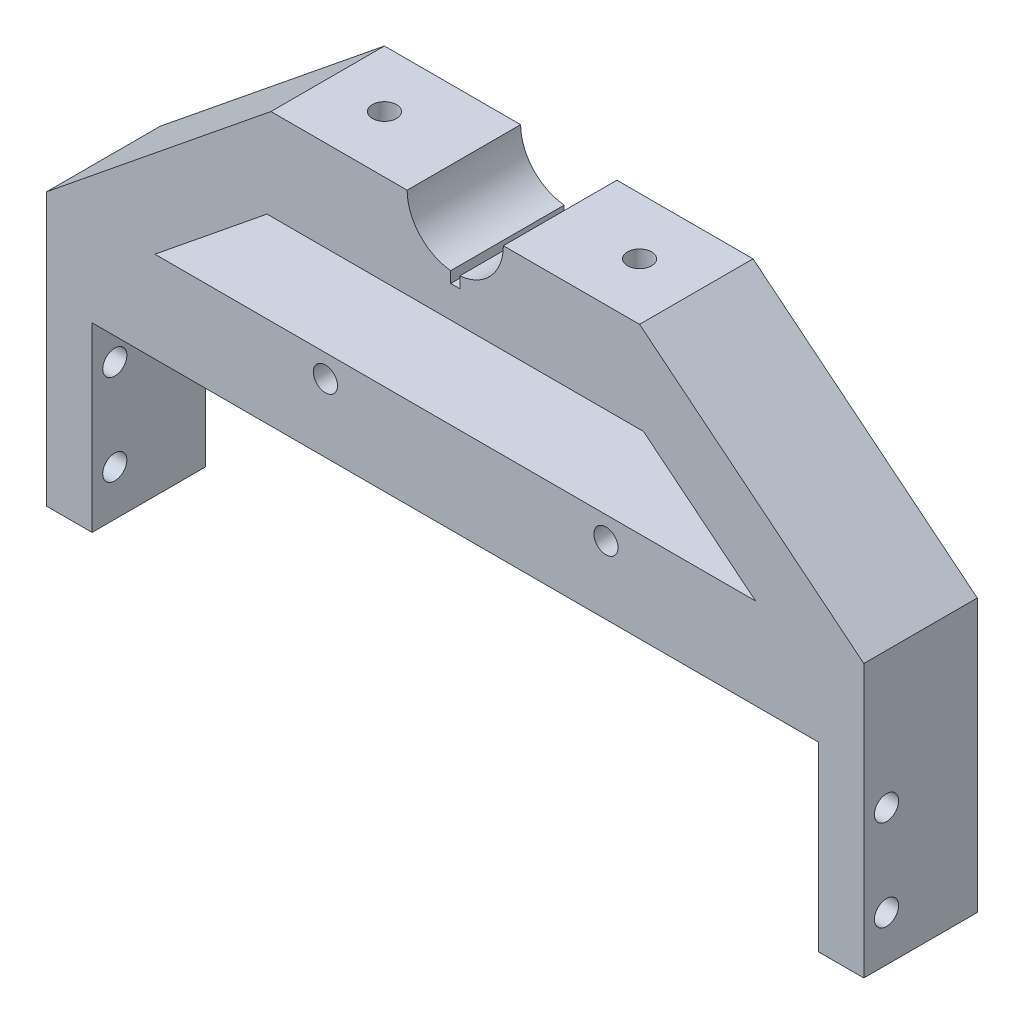
ISO-10303-21;
HEADER;
FILE_DESCRIPTION(('STEP AP214'),'2;1');
FILE_NAME('part.step','',(''),(''),'','','');
FILE_SCHEMA(('AUTOMOTIVE_DESIGN { 1 0 10303 214 1 1 1 1 }'));
ENDSEC;
DATA;
#1=APPLICATION_CONTEXT('core data for automotive mechanical design processes');
#2=APPLICATION_PROTOCOL_DEFINITION('international standard','automotive_design',2000,#1);
#3=PRODUCT_CONTEXT('',#1,'mechanical');
#4=PRODUCT('Part','Part','',(#3));
#5=PRODUCT_RELATED_PRODUCT_CATEGORY('part','',(#4));
#6=PRODUCT_DEFINITION_FORMATION('','',#4);
#7=PRODUCT_DEFINITION_CONTEXT('part definition',#1,'design');
#8=PRODUCT_DEFINITION('design','',#6,#7);
#9=PRODUCT_DEFINITION_SHAPE('','',#8);
#10=(LENGTH_UNIT() NAMED_UNIT(*) SI_UNIT(.MILLI.,.METRE.));
#11=(NAMED_UNIT(*) PLANE_ANGLE_UNIT() SI_UNIT($,.RADIAN.));
#12=(NAMED_UNIT(*) SI_UNIT($,.STERADIAN.) SOLID_ANGLE_UNIT());
#13=UNCERTAINTY_MEASURE_WITH_UNIT(LENGTH_MEASURE(1.E-05),#10,'distance_accuracy_value','');
#14=(GEOMETRIC_REPRESENTATION_CONTEXT(3) GLOBAL_UNCERTAINTY_ASSIGNED_CONTEXT((#13)) GLOBAL_UNIT_ASSIGNED_CONTEXT((#10,
#11,#12)) REPRESENTATION_CONTEXT('',''));
#15=CARTESIAN_POINT('',(0.,0.,0.));
#16=DIRECTION('',(0.,0.,1.));
#17=DIRECTION('',(1.,0.,0.));
#18=AXIS2_PLACEMENT_3D('',#15,#16,#17);
#19=CARTESIAN_POINT('',(152.4,152.4,50.8));
#20=DIRECTION('',(0.,0.,-1.));
#21=DIRECTION('',(-1.,0.,0.));
#22=AXIS2_PLACEMENT_3D('',#19,#20,#21);
#23=CYLINDRICAL_SURFACE('',#22,13.462);
#24=DIRECTION('',(0.,0.,-1.));
#25=VECTOR('',#24,1.);
#26=CARTESIAN_POINT('',(151.13,138.998039546395,50.8));
#27=LINE('',#26,#25);
#28=CARTESIAN_POINT('',(151.13,138.998039546395,0.));
#29=VERTEX_POINT('',#28);
#30=CARTESIAN_POINT('',(151.13,138.998039546395,31.75));
#31=VERTEX_POINT('',#30);
#32=EDGE_CURVE('E215',#29,#31,#27,.F.);
#33=ORIENTED_EDGE('',*,*,#32,.F.);
#34=CARTESIAN_POINT('',(152.4,152.4,0.));
#35=DIRECTION('',(0.,0.,-1.));
#36=DIRECTION('',(1.,0.,0.));
#37=AXIS2_PLACEMENT_3D('',#34,#35,#36);
#38=CIRCLE('',#37,13.462);
#39=CARTESIAN_POINT('',(138.938,152.4,0.));
#40=VERTEX_POINT('',#39);
#41=EDGE_CURVE('E381',#29,#40,#38,.T.);
#42=ORIENTED_EDGE('',*,*,#41,.T.);
#43=DIRECTION('',(0.,0.,-1.));
#44=VECTOR('',#43,1.);
#45=CARTESIAN_POINT('',(138.938,152.4,50.8));
#46=LINE('',#45,#44);
#47=CARTESIAN_POINT('',(138.938,152.4,31.75));
#48=VERTEX_POINT('',#47);
#49=EDGE_CURVE('E400',#48,#40,#46,.T.);
#50=ORIENTED_EDGE('',*,*,#49,.F.);
#51=CARTESIAN_POINT('',(152.4,152.4,31.75));
#52=DIRECTION('',(0.,0.,-1.));
#53=DIRECTION('',(-1.,0.,0.));
#54=AXIS2_PLACEMENT_3D('',#51,#52,#53);
#55=CIRCLE('',#54,13.462);
#56=EDGE_CURVE('E299',#48,#31,#55,.F.);
#57=ORIENTED_EDGE('',*,*,#56,.T.);
#58=EDGE_LOOP('',(#33,#42,#50,#57));
#59=FACE_BOUND('',#58,.T.);
#60=ADVANCED_FACE('F39',(#59),#23,.F.);
#61=DIRECTION('',(0.,0.,-1.));
#62=VECTOR('',#61,1.);
#63=CARTESIAN_POINT('',(153.67,138.998039546395,50.8));
#64=LINE('',#63,#62);
#65=CARTESIAN_POINT('',(153.67,138.998039546395,31.75));
#66=VERTEX_POINT('',#65);
#67=CARTESIAN_POINT('',(153.67,138.998039546395,2.52176574657466E-13));
#68=VERTEX_POINT('',#67);
#69=EDGE_CURVE('E212',#66,#68,#64,.T.);
#70=ORIENTED_EDGE('',*,*,#69,.F.);
#71=CARTESIAN_POINT('',(165.862,152.4,31.75));
#72=VERTEX_POINT('',#71);
#73=EDGE_CURVE('E202',#66,#72,#55,.F.);
#74=ORIENTED_EDGE('',*,*,#73,.T.);
#75=DIRECTION('',(0.,0.,-1.));
#76=VECTOR('',#75,1.);
#77=CARTESIAN_POINT('',(165.862,152.4,50.8));
#78=LINE('',#77,#76);
#79=CARTESIAN_POINT('',(165.862,152.4,0.));
#80=VERTEX_POINT('',#79);
#81=EDGE_CURVE('E404',#72,#80,#78,.T.);
#82=ORIENTED_EDGE('',*,*,#81,.T.);
#83=EDGE_CURVE('E382',#80,#68,#38,.T.);
#84=ORIENTED_EDGE('',*,*,#83,.T.);
#85=EDGE_LOOP('',(#70,#74,#82,#84));
#86=FACE_BOUND('',#85,.T.);
#87=ADVANCED_FACE('F478',(#86),#23,.F.);
#88=CARTESIAN_POINT('',(152.4,152.4,0.));
#89=DIRECTION('',(0.,0.,1.));
#90=DIRECTION('',(1.,0.,0.));
#91=AXIS2_PLACEMENT_3D('',#88,#89,#90);
#92=PLANE('',#91);
#93=CARTESIAN_POINT('',(116.078,95.25,0.));
#94=DIRECTION('',(0.,0.,1.));
#95=DIRECTION('',(1.,0.,0.));
#96=AXIS2_PLACEMENT_3D('',#93,#94,#95);
#97=CIRCLE('',#96,3.37819999999999);
#98=CARTESIAN_POINT('',(119.4562,95.25,0.));
#99=VERTEX_POINT('',#98);
#100=EDGE_CURVE('E197',#99,#99,#97,.F.);
#101=ORIENTED_EDGE('',*,*,#100,.F.);
#102=EDGE_LOOP('',(#101));
#103=FACE_BOUND('',#102,.T.);
#104=CARTESIAN_POINT('',(194.564,95.25,0.));
#105=DIRECTION('',(0.,0.,1.));
#106=DIRECTION('',(1.,0.,0.));
#107=AXIS2_PLACEMENT_3D('',#104,#105,#106);
#108=CIRCLE('',#107,3.37819999999999);
#109=CARTESIAN_POINT('',(197.9422,95.25,0.));
#110=VERTEX_POINT('',#109);
#111=EDGE_CURVE('E490',#110,#110,#108,.F.);
#112=ORIENTED_EDGE('',*,*,#111,.F.);
#113=EDGE_LOOP('',(#112));
#114=FACE_BOUND('',#113,.T.);
#115=DIRECTION('',(-0.777171592090802,0.629288738535061,0.));
#116=VECTOR('',#115,1.);
#117=CARTESIAN_POINT('',(160.83082409555,162.812067758004,0.));
#118=LINE('',#117,#116);
#119=CARTESIAN_POINT('',(236.427727776685,101.6,0.));
#120=VERTEX_POINT('',#119);
#121=CARTESIAN_POINT('',(205.058727776685,127.,0.));
#122=VERTEX_POINT('',#121);
#123=EDGE_CURVE('E260',#120,#122,#118,.T.);
#124=ORIENTED_EDGE('',*,*,#123,.T.);
#125=DIRECTION('',(-1.,0.,0.));
#126=VECTOR('',#125,1.);
#127=CARTESIAN_POINT('',(152.4,127.,0.));
#128=LINE('',#127,#126);
#129=CARTESIAN_POINT('',(99.7412722233152,127.,0.));
#130=VERTEX_POINT('',#129);
#131=EDGE_CURVE('E248',#122,#130,#128,.T.);
#132=ORIENTED_EDGE('',*,*,#131,.T.);
#133=DIRECTION('',(-0.777171592090801,-0.629288738535062,0.));
#134=VECTOR('',#133,1.);
#135=CARTESIAN_POINT('',(143.96917590445,162.812067758004,0.));
#136=LINE('',#135,#134);
#137=CARTESIAN_POINT('',(68.3722722233152,101.6,0.));
#138=VERTEX_POINT('',#137);
#139=EDGE_CURVE('E252',#130,#138,#136,.T.);
#140=ORIENTED_EDGE('',*,*,#139,.T.);
#141=DIRECTION('',(1.,0.,0.));
#142=VECTOR('',#141,1.);
#143=CARTESIAN_POINT('',(152.4,101.6,0.));
#144=LINE('',#143,#142);
#145=EDGE_CURVE('E256',#138,#120,#144,.T.);
#146=ORIENTED_EDGE('',*,*,#145,.T.);
#147=EDGE_LOOP('',(#124,#132,#140,#146));
#148=FACE_BOUND('',#147,.T.);
#149=DIRECTION('',(0.,1.,0.));
#150=VECTOR('',#149,1.);
#151=CARTESIAN_POINT('',(151.13,135.89,0.));
#152=LINE('',#151,#150);
#153=CARTESIAN_POINT('',(151.13,135.89,0.));
#154=VERTEX_POINT('',#153);
#155=EDGE_CURVE('E207',#154,#29,#152,.T.);
#156=ORIENTED_EDGE('',*,*,#155,.F.);
#157=DIRECTION('',(1.,0.,0.));
#158=VECTOR('',#157,1.);
#159=CARTESIAN_POINT('',(0.,135.89,0.));
#160=LINE('',#159,#158);
#161=CARTESIAN_POINT('',(153.67,135.89,2.52176574657466E-13));
#162=VERTEX_POINT('',#161);
#163=EDGE_CURVE('E189',#154,#162,#160,.T.);
#164=ORIENTED_EDGE('',*,*,#163,.T.);
#165=DIRECTION('',(0.,1.,0.));
#166=VECTOR('',#165,1.);
#167=CARTESIAN_POINT('',(153.67,135.89,2.52176574657466E-13));
#168=LINE('',#167,#166);
#169=EDGE_CURVE('E184',#162,#68,#168,.T.);
#170=ORIENTED_EDGE('',*,*,#169,.T.);
#171=ORIENTED_EDGE('',*,*,#83,.F.);
#172=DIRECTION('',(-1.,0.,0.));
#173=VECTOR('',#172,1.);
#174=CARTESIAN_POINT('',(165.862,152.4,0.));
#175=LINE('',#174,#173);
#176=CARTESIAN_POINT('',(203.962,152.4,0.));
#177=VERTEX_POINT('',#176);
#178=EDGE_CURVE('E377',#177,#80,#175,.T.);
#179=ORIENTED_EDGE('',*,*,#178,.F.);
#180=DIRECTION('',(-0.777171592090801,0.629288738535062,0.));
#181=VECTOR('',#180,1.);
#182=CARTESIAN_POINT('',(266.7,101.6,0.));
#183=LINE('',#182,#181);
#184=CARTESIAN_POINT('',(266.7,101.6,0.));
#185=VERTEX_POINT('',#184);
#186=EDGE_CURVE('E373',#185,#177,#183,.T.);
#187=ORIENTED_EDGE('',*,*,#186,.F.);
#188=DIRECTION('',(0.,1.,0.));
#189=VECTOR('',#188,1.);
#190=CARTESIAN_POINT('',(266.7,0.,0.));
#191=LINE('',#190,#189);
#192=CARTESIAN_POINT('',(266.7,25.4,0.));
#193=VERTEX_POINT('',#192);
#194=EDGE_CURVE('E370',#193,#185,#191,.T.);
#195=ORIENTED_EDGE('',*,*,#194,.F.);
#196=DIRECTION('',(-1.,0.,0.));
#197=VECTOR('',#196,1.);
#198=CARTESIAN_POINT('',(152.4,25.4,0.));
#199=LINE('',#198,#197);
#200=CARTESIAN_POINT('',(254.,25.4,0.));
#201=VERTEX_POINT('',#200);
#202=EDGE_CURVE('E287',#193,#201,#199,.T.);
#203=ORIENTED_EDGE('',*,*,#202,.T.);
#204=DIRECTION('',(0.,-1.,0.));
#205=VECTOR('',#204,1.);
#206=CARTESIAN_POINT('',(254.,76.2,0.));
#207=LINE('',#206,#205);
#208=CARTESIAN_POINT('',(254.,76.2,0.));
#209=VERTEX_POINT('',#208);
#210=EDGE_CURVE('E366',#209,#201,#207,.T.);
#211=ORIENTED_EDGE('',*,*,#210,.F.);
#212=DIRECTION('',(1.,0.,0.));
#213=VECTOR('',#212,1.);
#214=CARTESIAN_POINT('',(50.8,76.2,0.));
#215=LINE('',#214,#213);
#216=CARTESIAN_POINT('',(50.8,76.2,0.));
#217=VERTEX_POINT('',#216);
#218=EDGE_CURVE('E362',#217,#209,#215,.T.);
#219=ORIENTED_EDGE('',*,*,#218,.F.);
#220=DIRECTION('',(0.,1.,0.));
#221=VECTOR('',#220,1.);
#222=CARTESIAN_POINT('',(50.8,0.,0.));
#223=LINE('',#222,#221);
#224=CARTESIAN_POINT('',(50.8,25.4,0.));
#225=VERTEX_POINT('',#224);
#226=EDGE_CURVE('E358',#225,#217,#223,.T.);
#227=ORIENTED_EDGE('',*,*,#226,.F.);
#228=CARTESIAN_POINT('',(38.1,25.4,0.));
#229=VERTEX_POINT('',#228);
#230=EDGE_CURVE('E280',#225,#229,#199,.T.);
#231=ORIENTED_EDGE('',*,*,#230,.T.);
#232=DIRECTION('',(0.,-1.,0.));
#233=VECTOR('',#232,1.);
#234=CARTESIAN_POINT('',(38.1,0.,0.));
#235=LINE('',#234,#233);
#236=CARTESIAN_POINT('',(38.1,101.6,0.));
#237=VERTEX_POINT('',#236);
#238=EDGE_CURVE('E354',#237,#229,#235,.T.);
#239=ORIENTED_EDGE('',*,*,#238,.F.);
#240=DIRECTION('',(-0.777171592090801,-0.629288738535062,0.));
#241=VECTOR('',#240,1.);
#242=CARTESIAN_POINT('',(38.1,101.6,0.));
#243=LINE('',#242,#241);
#244=CARTESIAN_POINT('',(100.838,152.4,0.));
#245=VERTEX_POINT('',#244);
#246=EDGE_CURVE('E390',#245,#237,#243,.T.);
#247=ORIENTED_EDGE('',*,*,#246,.F.);
#248=DIRECTION('',(-1.,0.,0.));
#249=VECTOR('',#248,1.);
#250=CARTESIAN_POINT('',(100.838,152.4,0.));
#251=LINE('',#250,#249);
#252=EDGE_CURVE('E386',#40,#245,#251,.T.);
#253=ORIENTED_EDGE('',*,*,#252,.F.);
#254=ORIENTED_EDGE('',*,*,#41,.F.);
#255=EDGE_LOOP('',(#156,#164,#170,#171,#179,#187,#195,#203,#211,#219,#227,#231,#239,#247,#253,#254));
#256=FACE_BOUND('',#255,.T.);
#257=ADVANCED_FACE('F444',(#103,#114,#148,#256),#92,.F.);
#258=CARTESIAN_POINT('',(0.,0.,31.75));
#259=DIRECTION('',(0.,0.,-1.));
#260=DIRECTION('',(-1.,0.,0.));
#261=AXIS2_PLACEMENT_3D('',#258,#259,#260);
#262=PLANE('',#261);
#263=CARTESIAN_POINT('',(116.078,95.25,31.75));
#264=DIRECTION('',(0.,0.,1.));
#265=DIRECTION('',(1.,0.,0.));
#266=AXIS2_PLACEMENT_3D('',#263,#264,#265);
#267=CIRCLE('',#266,3.37819999999999);
#268=CARTESIAN_POINT('',(119.4562,95.25,31.75));
#269=VERTEX_POINT('',#268);
#270=EDGE_CURVE('E494',#269,#269,#267,.T.);
#271=ORIENTED_EDGE('',*,*,#270,.F.);
#272=EDGE_LOOP('',(#271));
#273=FACE_BOUND('',#272,.T.);
#274=CARTESIAN_POINT('',(194.564,95.25,31.75));
#275=DIRECTION('',(0.,0.,1.));
#276=DIRECTION('',(1.,0.,0.));
#277=AXIS2_PLACEMENT_3D('',#274,#275,#276);
#278=CIRCLE('',#277,3.37819999999999);
#279=CARTESIAN_POINT('',(197.9422,95.25,31.75));
#280=VERTEX_POINT('',#279);
#281=EDGE_CURVE('E495',#280,#280,#278,.T.);
#282=ORIENTED_EDGE('',*,*,#281,.F.);
#283=EDGE_LOOP('',(#282));
#284=FACE_BOUND('',#283,.T.);
#285=DIRECTION('',(-0.777171592090801,-0.629288738535062,0.));
#286=VECTOR('',#285,1.);
#287=CARTESIAN_POINT('',(68.3722722233152,101.6,31.75));
#288=LINE('',#287,#286);
#289=CARTESIAN_POINT('',(99.7412722233152,127.,31.75));
#290=VERTEX_POINT('',#289);
#291=CARTESIAN_POINT('',(68.3722722233152,101.6,31.75));
#292=VERTEX_POINT('',#291);
#293=EDGE_CURVE('E221',#290,#292,#288,.T.);
#294=ORIENTED_EDGE('',*,*,#293,.F.);
#295=DIRECTION('',(-1.,0.,0.));
#296=VECTOR('',#295,1.);
#297=CARTESIAN_POINT('',(99.7412722233152,127.,31.75));
#298=LINE('',#297,#296);
#299=CARTESIAN_POINT('',(205.058727776685,127.,31.75));
#300=VERTEX_POINT('',#299);
#301=EDGE_CURVE('E218',#300,#290,#298,.T.);
#302=ORIENTED_EDGE('',*,*,#301,.F.);
#303=DIRECTION('',(-0.777171592090802,0.629288738535061,0.));
#304=VECTOR('',#303,1.);
#305=CARTESIAN_POINT('',(205.058727776685,127.,31.75));
#306=LINE('',#305,#304);
#307=CARTESIAN_POINT('',(236.427727776685,101.6,31.75));
#308=VERTEX_POINT('',#307);
#309=EDGE_CURVE('E228',#308,#300,#306,.T.);
#310=ORIENTED_EDGE('',*,*,#309,.F.);
#311=DIRECTION('',(1.,0.,0.));
#312=VECTOR('',#311,1.);
#313=CARTESIAN_POINT('',(68.3722722233152,101.6,31.75));
#314=LINE('',#313,#312);
#315=EDGE_CURVE('E224',#292,#308,#314,.T.);
#316=ORIENTED_EDGE('',*,*,#315,.F.);
#317=EDGE_LOOP('',(#294,#302,#310,#316));
#318=FACE_BOUND('',#317,.T.);
#319=DIRECTION('',(0.,1.,0.));
#320=VECTOR('',#319,1.);
#321=CARTESIAN_POINT('',(151.13,135.89,31.75));
#322=LINE('',#321,#320);
#323=CARTESIAN_POINT('',(151.13,135.89,31.75));
#324=VERTEX_POINT('',#323);
#325=EDGE_CURVE('E56',#324,#31,#322,.T.);
#326=ORIENTED_EDGE('',*,*,#325,.T.);
#327=ORIENTED_EDGE('',*,*,#56,.F.);
#328=DIRECTION('',(1.,0.,0.));
#329=VECTOR('',#328,1.);
#330=CARTESIAN_POINT('',(100.838,152.4,31.75));
#331=LINE('',#330,#329);
#332=CARTESIAN_POINT('',(100.838,152.4,31.75));
#333=VERTEX_POINT('',#332);
#334=EDGE_CURVE('E295',#333,#48,#331,.T.);
#335=ORIENTED_EDGE('',*,*,#334,.F.);
#336=DIRECTION('',(0.777171592090801,0.629288738535062,0.));
#337=VECTOR('',#336,1.);
#338=CARTESIAN_POINT('',(38.1,101.6,31.75));
#339=LINE('',#338,#337);
#340=CARTESIAN_POINT('',(38.1,101.6,31.75));
#341=VERTEX_POINT('',#340);
#342=EDGE_CURVE('E49',#341,#333,#339,.T.);
#343=ORIENTED_EDGE('',*,*,#342,.F.);
#344=DIRECTION('',(0.,1.,0.));
#345=VECTOR('',#344,1.);
#346=CARTESIAN_POINT('',(38.1,0.,31.75));
#347=LINE('',#346,#345);
#348=CARTESIAN_POINT('',(38.1,25.4,31.75));
#349=VERTEX_POINT('',#348);
#350=EDGE_CURVE('E326',#349,#341,#347,.T.);
#351=ORIENTED_EDGE('',*,*,#350,.F.);
#352=DIRECTION('',(1.,0.,0.));
#353=VECTOR('',#352,1.);
#354=CARTESIAN_POINT('',(0.,25.4,31.75));
#355=LINE('',#354,#353);
#356=CARTESIAN_POINT('',(50.8,25.4,31.75));
#357=VERTEX_POINT('',#356);
#358=EDGE_CURVE('E11',#349,#357,#355,.T.);
#359=ORIENTED_EDGE('',*,*,#358,.T.);
#360=DIRECTION('',(0.,-1.,0.));
#361=VECTOR('',#360,1.);
#362=CARTESIAN_POINT('',(50.8,0.,31.75));
#363=LINE('',#362,#361);
#364=CARTESIAN_POINT('',(50.8,76.2,31.75));
#365=VERTEX_POINT('',#364);
#366=EDGE_CURVE('E322',#365,#357,#363,.T.);
#367=ORIENTED_EDGE('',*,*,#366,.F.);
#368=DIRECTION('',(-1.,0.,0.));
#369=VECTOR('',#368,1.);
#370=CARTESIAN_POINT('',(50.8,76.2,31.75));
#371=LINE('',#370,#369);
#372=CARTESIAN_POINT('',(254.,76.2,31.75));
#373=VERTEX_POINT('',#372);
#374=EDGE_CURVE('E318',#373,#365,#371,.T.);
#375=ORIENTED_EDGE('',*,*,#374,.F.);
#376=DIRECTION('',(0.,1.,0.));
#377=VECTOR('',#376,1.);
#378=CARTESIAN_POINT('',(254.,76.2,31.75));
#379=LINE('',#378,#377);
#380=CARTESIAN_POINT('',(254.,25.4,31.75));
#381=VERTEX_POINT('',#380);
#382=EDGE_CURVE('E315',#381,#373,#379,.T.);
#383=ORIENTED_EDGE('',*,*,#382,.F.);
#384=DIRECTION('',(-1.,0.,0.));
#385=VECTOR('',#384,1.);
#386=CARTESIAN_POINT('',(38.1,25.4,31.75));
#387=LINE('',#386,#385);
#388=CARTESIAN_POINT('',(266.7,25.4,31.75));
#389=VERTEX_POINT('',#388);
#390=EDGE_CURVE('E269',#389,#381,#387,.T.);
#391=ORIENTED_EDGE('',*,*,#390,.F.);
#392=DIRECTION('',(0.,-1.,0.));
#393=VECTOR('',#392,1.);
#394=CARTESIAN_POINT('',(266.7,0.,31.75));
#395=LINE('',#394,#393);
#396=CARTESIAN_POINT('',(266.7,101.6,31.75));
#397=VERTEX_POINT('',#396);
#398=EDGE_CURVE('E311',#397,#389,#395,.T.);
#399=ORIENTED_EDGE('',*,*,#398,.F.);
#400=DIRECTION('',(0.777171592090802,-0.629288738535062,0.));
#401=VECTOR('',#400,1.);
#402=CARTESIAN_POINT('',(266.7,101.6,31.75));
#403=LINE('',#402,#401);
#404=CARTESIAN_POINT('',(203.962,152.4,31.75));
#405=VERTEX_POINT('',#404);
#406=EDGE_CURVE('E307',#405,#397,#403,.T.);
#407=ORIENTED_EDGE('',*,*,#406,.F.);
#408=DIRECTION('',(1.,0.,0.));
#409=VECTOR('',#408,1.);
#410=CARTESIAN_POINT('',(165.862,152.4,31.75));
#411=LINE('',#410,#409);
#412=EDGE_CURVE('E303',#72,#405,#411,.T.);
#413=ORIENTED_EDGE('',*,*,#412,.F.);
#414=ORIENTED_EDGE('',*,*,#73,.F.);
#415=DIRECTION('',(0.,1.,0.));
#416=VECTOR('',#415,1.);
#417=CARTESIAN_POINT('',(153.67,135.89,31.75));
#418=LINE('',#417,#416);
#419=CARTESIAN_POINT('',(153.67,135.89,31.75));
#420=VERTEX_POINT('',#419);
#421=EDGE_CURVE('E181',#420,#66,#418,.T.);
#422=ORIENTED_EDGE('',*,*,#421,.F.);
#423=DIRECTION('',(-1.,0.,0.));
#424=VECTOR('',#423,1.);
#425=CARTESIAN_POINT('',(0.,135.89,31.75));
#426=LINE('',#425,#424);
#427=EDGE_CURVE('E190',#420,#324,#426,.T.);
#428=ORIENTED_EDGE('',*,*,#427,.T.);
#429=EDGE_LOOP('',(#326,#327,#335,#343,#351,#359,#367,#375,#383,#391,#399,#407,#413,#414,#422,#428));
#430=FACE_BOUND('',#429,.T.);
#431=ADVANCED_FACE('F200',(#273,#284,#318,#430),#262,.F.);
#432=CARTESIAN_POINT('',(38.1,0.,50.8));
#433=DIRECTION('',(1.,0.,0.));
#434=DIRECTION('',(0.,0.,-1.));
#435=AXIS2_PLACEMENT_3D('',#432,#433,#434);
#436=PLANE('',#435);
#437=CARTESIAN_POINT('',(38.1,63.5,25.4));
#438=DIRECTION('',(-1.,0.,0.));
#439=DIRECTION('',(0.,0.,1.));
#440=AXIS2_PLACEMENT_3D('',#437,#438,#439);
#441=CIRCLE('',#440,3.3782);
#442=CARTESIAN_POINT('',(38.1,63.5,28.7782));
#443=VERTEX_POINT('',#442);
#444=EDGE_CURVE('E346',#443,#443,#441,.T.);
#445=ORIENTED_EDGE('',*,*,#444,.F.);
#446=EDGE_LOOP('',(#445));
#447=FACE_BOUND('',#446,.T.);
#448=CARTESIAN_POINT('',(38.1,38.1,25.4));
#449=DIRECTION('',(-1.,0.,0.));
#450=DIRECTION('',(0.,0.,1.));
#451=AXIS2_PLACEMENT_3D('',#448,#449,#450);
#452=CIRCLE('',#451,3.3782);
#453=CARTESIAN_POINT('',(38.1,38.1,28.7782));
#454=VERTEX_POINT('',#453);
#455=EDGE_CURVE('E345',#454,#454,#452,.T.);
#456=ORIENTED_EDGE('',*,*,#455,.F.);
#457=EDGE_LOOP('',(#456));
#458=FACE_BOUND('',#457,.T.);
#459=ORIENTED_EDGE('',*,*,#238,.T.);
#460=DIRECTION('',(0.,0.,1.));
#461=VECTOR('',#460,1.);
#462=CARTESIAN_POINT('',(38.1,25.4,-7.62));
#463=LINE('',#462,#461);
#464=EDGE_CURVE('E276',#229,#349,#463,.T.);
#465=ORIENTED_EDGE('',*,*,#464,.T.);
#466=ORIENTED_EDGE('',*,*,#350,.T.);
#467=DIRECTION('',(0.,0.,-1.));
#468=VECTOR('',#467,1.);
#469=CARTESIAN_POINT('',(38.1,101.6,50.8));
#470=LINE('',#469,#468);
#471=EDGE_CURVE('E394',#341,#237,#470,.T.);
#472=ORIENTED_EDGE('',*,*,#471,.T.);
#473=EDGE_LOOP('',(#459,#465,#466,#472));
#474=FACE_BOUND('',#473,.T.);
#475=ADVANCED_FACE('F41',(#447,#458,#474),#436,.F.);
#476=CARTESIAN_POINT('',(50.8,0.,50.8));
#477=DIRECTION('',(-1.,0.,0.));
#478=DIRECTION('',(0.,0.,1.));
#479=AXIS2_PLACEMENT_3D('',#476,#477,#478);
#480=PLANE('',#479);
#481=CARTESIAN_POINT('',(50.8,63.5,25.4));
#482=DIRECTION('',(-1.,0.,0.));
#483=DIRECTION('',(0.,0.,1.));
#484=AXIS2_PLACEMENT_3D('',#481,#482,#483);
#485=CIRCLE('',#484,3.3782);
#486=CARTESIAN_POINT('',(50.8,63.5,28.7782));
#487=VERTEX_POINT('',#486);
#488=EDGE_CURVE('E359',#487,#487,#485,.T.);
#489=ORIENTED_EDGE('',*,*,#488,.T.);
#490=EDGE_LOOP('',(#489));
#491=FACE_BOUND('',#490,.T.);
#492=CARTESIAN_POINT('',(50.8,38.1,25.4));
#493=DIRECTION('',(-1.,0.,0.));
#494=DIRECTION('',(0.,0.,1.));
#495=AXIS2_PLACEMENT_3D('',#492,#493,#494);
#496=CIRCLE('',#495,3.3782);
#497=CARTESIAN_POINT('',(50.8,38.1,28.7782));
#498=VERTEX_POINT('',#497);
#499=EDGE_CURVE('E350',#498,#498,#496,.T.);
#500=ORIENTED_EDGE('',*,*,#499,.T.);
#501=EDGE_LOOP('',(#500));
#502=FACE_BOUND('',#501,.T.);
#503=ORIENTED_EDGE('',*,*,#366,.T.);
#504=DIRECTION('',(0.,0.,-1.));
#505=VECTOR('',#504,1.);
#506=CARTESIAN_POINT('',(50.8,25.4,50.8));
#507=LINE('',#506,#505);
#508=EDGE_CURVE('E286',#357,#225,#507,.T.);
#509=ORIENTED_EDGE('',*,*,#508,.T.);
#510=ORIENTED_EDGE('',*,*,#226,.T.);
#511=DIRECTION('',(0.,0.,-1.));
#512=VECTOR('',#511,1.);
#513=CARTESIAN_POINT('',(50.8,76.2,50.8));
#514=LINE('',#513,#512);
#515=EDGE_CURVE('E417',#365,#217,#514,.T.);
#516=ORIENTED_EDGE('',*,*,#515,.F.);
#517=EDGE_LOOP('',(#503,#509,#510,#516));
#518=FACE_BOUND('',#517,.T.);
#519=ADVANCED_FACE('F451',(#491,#502,#518),#480,.F.);
#520=CARTESIAN_POINT('',(50.8,76.2,50.8));
#521=DIRECTION('',(0.,1.,0.));
#522=DIRECTION('',(0.,0.,1.));
#523=AXIS2_PLACEMENT_3D('',#520,#521,#522);
#524=PLANE('',#523);
#525=DIRECTION('',(0.,0.,-1.));
#526=VECTOR('',#525,1.);
#527=CARTESIAN_POINT('',(254.,76.2,50.8));
#528=LINE('',#527,#526);
#529=EDGE_CURVE('E414',#373,#209,#528,.T.);
#530=ORIENTED_EDGE('',*,*,#529,.F.);
#531=ORIENTED_EDGE('',*,*,#374,.T.);
#532=ORIENTED_EDGE('',*,*,#515,.T.);
#533=ORIENTED_EDGE('',*,*,#218,.T.);
#534=EDGE_LOOP('',(#530,#531,#532,#533));
#535=FACE_BOUND('',#534,.T.);
#536=ADVANCED_FACE('F455',(#535),#524,.F.);
#537=CARTESIAN_POINT('',(254.,76.2,50.8));
#538=DIRECTION('',(1.,0.,0.));
#539=DIRECTION('',(0.,0.,-1.));
#540=AXIS2_PLACEMENT_3D('',#537,#538,#539);
#541=PLANE('',#540);
#542=CARTESIAN_POINT('',(254.,63.5,25.4));
#543=DIRECTION('',(1.,0.,0.));
#544=DIRECTION('',(0.,0.,-1.));
#545=AXIS2_PLACEMENT_3D('',#542,#543,#544);
#546=CIRCLE('',#545,3.3782);
#547=CARTESIAN_POINT('',(254.,63.5,22.0218));
#548=VERTEX_POINT('',#547);
#549=EDGE_CURVE('E341',#548,#548,#546,.T.);
#550=ORIENTED_EDGE('',*,*,#549,.T.);
#551=EDGE_LOOP('',(#550));
#552=FACE_BOUND('',#551,.T.);
#553=CARTESIAN_POINT('',(254.,38.1,25.4));
#554=DIRECTION('',(1.,0.,0.));
#555=DIRECTION('',(0.,0.,-1.));
#556=AXIS2_PLACEMENT_3D('',#553,#554,#555);
#557=CIRCLE('',#556,3.3782);
#558=CARTESIAN_POINT('',(254.,38.1,22.0218));
#559=VERTEX_POINT('',#558);
#560=EDGE_CURVE('E334',#559,#559,#557,.T.);
#561=ORIENTED_EDGE('',*,*,#560,.T.);
#562=EDGE_LOOP('',(#561));
#563=FACE_BOUND('',#562,.T.);
#564=ORIENTED_EDGE('',*,*,#210,.T.);
#565=DIRECTION('',(0.,0.,1.));
#566=VECTOR('',#565,1.);
#567=CARTESIAN_POINT('',(254.,25.4,50.8));
#568=LINE('',#567,#566);
#569=EDGE_CURVE('E291',#201,#381,#568,.T.);
#570=ORIENTED_EDGE('',*,*,#569,.T.);
#571=ORIENTED_EDGE('',*,*,#382,.T.);
#572=ORIENTED_EDGE('',*,*,#529,.T.);
#573=EDGE_LOOP('',(#564,#570,#571,#572));
#574=FACE_BOUND('',#573,.T.);
#575=ADVANCED_FACE('F460',(#552,#563,#574),#541,.F.);
#576=CARTESIAN_POINT('',(266.7,0.,50.8));
#577=DIRECTION('',(-1.,0.,0.));
#578=DIRECTION('',(0.,0.,1.));
#579=AXIS2_PLACEMENT_3D('',#576,#577,#578);
#580=PLANE('',#579);
#581=CARTESIAN_POINT('',(266.7,63.5,25.4));
#582=DIRECTION('',(1.,0.,0.));
#583=DIRECTION('',(0.,0.,-1.));
#584=AXIS2_PLACEMENT_3D('',#581,#582,#583);
#585=CIRCLE('',#584,3.3782);
#586=CARTESIAN_POINT('',(266.7,63.5,22.0218));
#587=VERTEX_POINT('',#586);
#588=EDGE_CURVE('E330',#587,#587,#585,.T.);
#589=ORIENTED_EDGE('',*,*,#588,.F.);
#590=EDGE_LOOP('',(#589));
#591=FACE_BOUND('',#590,.T.);
#592=CARTESIAN_POINT('',(266.7,38.1,25.4));
#593=DIRECTION('',(1.,0.,0.));
#594=DIRECTION('',(0.,0.,-1.));
#595=AXIS2_PLACEMENT_3D('',#592,#593,#594);
#596=CIRCLE('',#595,3.3782);
#597=CARTESIAN_POINT('',(266.7,38.1,22.0218));
#598=VERTEX_POINT('',#597);
#599=EDGE_CURVE('E329',#598,#598,#596,.T.);
#600=ORIENTED_EDGE('',*,*,#599,.F.);
#601=EDGE_LOOP('',(#600));
#602=FACE_BOUND('',#601,.T.);
#603=ORIENTED_EDGE('',*,*,#398,.T.);
#604=DIRECTION('',(0.,0.,1.));
#605=VECTOR('',#604,1.);
#606=CARTESIAN_POINT('',(266.7,25.4,-7.62));
#607=LINE('',#606,#605);
#608=EDGE_CURVE('E275',#193,#389,#607,.T.);
#609=ORIENTED_EDGE('',*,*,#608,.F.);
#610=ORIENTED_EDGE('',*,*,#194,.T.);
#611=DIRECTION('',(0.,0.,-1.));
#612=VECTOR('',#611,1.);
#613=CARTESIAN_POINT('',(266.7,101.6,50.8));
#614=LINE('',#613,#612);
#615=EDGE_CURVE('E410',#397,#185,#614,.T.);
#616=ORIENTED_EDGE('',*,*,#615,.F.);
#617=EDGE_LOOP('',(#603,#609,#610,#616));
#618=FACE_BOUND('',#617,.T.);
#619=ADVANCED_FACE('F467',(#591,#602,#618),#580,.F.);
#620=CARTESIAN_POINT('',(266.7,101.6,50.8));
#621=DIRECTION('',(-0.629288738535062,-0.777171592090801,0.));
#622=DIRECTION('',(0.777171592090802,-0.629288738535062,0.));
#623=AXIS2_PLACEMENT_3D('',#620,#621,#622);
#624=PLANE('',#623);
#625=DIRECTION('',(0.,0.,-1.));
#626=VECTOR('',#625,1.);
#627=CARTESIAN_POINT('',(203.962,152.4,50.8));
#628=LINE('',#627,#626);
#629=EDGE_CURVE('E407',#405,#177,#628,.T.);
#630=ORIENTED_EDGE('',*,*,#629,.F.);
#631=ORIENTED_EDGE('',*,*,#406,.T.);
#632=ORIENTED_EDGE('',*,*,#615,.T.);
#633=ORIENTED_EDGE('',*,*,#186,.T.);
#634=EDGE_LOOP('',(#630,#631,#632,#633));
#635=FACE_BOUND('',#634,.T.);
#636=ADVANCED_FACE('F471',(#635),#624,.F.);
#637=CARTESIAN_POINT('',(165.862,152.4,50.8));
#638=DIRECTION('',(0.,-1.,0.));
#639=DIRECTION('',(0.,0.,-1.));
#640=AXIS2_PLACEMENT_3D('',#637,#638,#639);
#641=PLANE('',#640);
#642=CARTESIAN_POINT('',(188.087,152.4,15.875));
#643=DIRECTION('',(0.,1.,0.));
#644=DIRECTION('',(0.,0.,1.));
#645=AXIS2_PLACEMENT_3D('',#642,#643,#644);
#646=CIRCLE('',#645,3.37819999999999);
#647=CARTESIAN_POINT('',(188.087,152.4,19.2532));
#648=VERTEX_POINT('',#647);
#649=EDGE_CURVE('E264',#648,#648,#646,.T.);
#650=ORIENTED_EDGE('',*,*,#649,.F.);
#651=EDGE_LOOP('',(#650));
#652=FACE_BOUND('',#651,.T.);
#653=ORIENTED_EDGE('',*,*,#81,.F.);
#654=ORIENTED_EDGE('',*,*,#412,.T.);
#655=ORIENTED_EDGE('',*,*,#629,.T.);
#656=ORIENTED_EDGE('',*,*,#178,.T.);
#657=EDGE_LOOP('',(#653,#654,#655,#656));
#658=FACE_BOUND('',#657,.T.);
#659=ADVANCED_FACE('F476',(#652,#658),#641,.F.);
#660=CARTESIAN_POINT('',(100.838,152.4,50.8));
#661=DIRECTION('',(0.,-1.,0.));
#662=DIRECTION('',(0.,0.,-1.));
#663=AXIS2_PLACEMENT_3D('',#660,#661,#662);
#664=PLANE('',#663);
#665=CARTESIAN_POINT('',(116.713,152.4,15.875));
#666=DIRECTION('',(0.,1.,0.));
#667=DIRECTION('',(0.,0.,1.));
#668=AXIS2_PLACEMENT_3D('',#665,#666,#667);
#669=CIRCLE('',#668,3.37819999999999);
#670=CARTESIAN_POINT('',(116.713,152.4,19.2532));
#671=VERTEX_POINT('',#670);
#672=EDGE_CURVE('E265',#671,#671,#669,.T.);
#673=ORIENTED_EDGE('',*,*,#672,.F.);
#674=EDGE_LOOP('',(#673));
#675=FACE_BOUND('',#674,.T.);
#676=DIRECTION('',(0.,0.,-1.));
#677=VECTOR('',#676,1.);
#678=CARTESIAN_POINT('',(100.838,152.4,50.8));
#679=LINE('',#678,#677);
#680=EDGE_CURVE('E397',#333,#245,#679,.T.);
#681=ORIENTED_EDGE('',*,*,#680,.F.);
#682=ORIENTED_EDGE('',*,*,#334,.T.);
#683=ORIENTED_EDGE('',*,*,#49,.T.);
#684=ORIENTED_EDGE('',*,*,#252,.T.);
#685=EDGE_LOOP('',(#681,#682,#683,#684));
#686=FACE_BOUND('',#685,.T.);
#687=ADVANCED_FACE('F436',(#675,#686),#664,.F.);
#688=CARTESIAN_POINT('',(38.1,101.6,50.8));
#689=DIRECTION('',(0.629288738535062,-0.777171592090801,0.));
#690=DIRECTION('',(0.777171592090801,0.629288738535062,0.));
#691=AXIS2_PLACEMENT_3D('',#688,#689,#690);
#692=PLANE('',#691);
#693=ORIENTED_EDGE('',*,*,#471,.F.);
#694=ORIENTED_EDGE('',*,*,#342,.T.);
#695=ORIENTED_EDGE('',*,*,#680,.T.);
#696=ORIENTED_EDGE('',*,*,#246,.T.);
#697=EDGE_LOOP('',(#693,#694,#695,#696));
#698=FACE_BOUND('',#697,.T.);
#699=ADVANCED_FACE('F433',(#698),#692,.F.);
#700=CARTESIAN_POINT('',(63.5,38.1,25.4));
#701=DIRECTION('',(-1.,0.,0.));
#702=DIRECTION('',(0.,0.,1.));
#703=AXIS2_PLACEMENT_3D('',#700,#701,#702);
#704=CYLINDRICAL_SURFACE('',#703,3.3782);
#705=ORIENTED_EDGE('',*,*,#455,.T.);
#706=EDGE_LOOP('',(#705));
#707=FACE_BOUND('',#706,.T.);
#708=ORIENTED_EDGE('',*,*,#499,.F.);
#709=EDGE_LOOP('',(#708));
#710=FACE_BOUND('',#709,.T.);
#711=ADVANCED_FACE('F569',(#707,#710),#704,.F.);
#712=CARTESIAN_POINT('',(63.5,63.5,25.4));
#713=DIRECTION('',(-1.,0.,0.));
#714=DIRECTION('',(0.,0.,1.));
#715=AXIS2_PLACEMENT_3D('',#712,#713,#714);
#716=CYLINDRICAL_SURFACE('',#715,3.3782);
#717=ORIENTED_EDGE('',*,*,#444,.T.);
#718=EDGE_LOOP('',(#717));
#719=FACE_BOUND('',#718,.T.);
#720=ORIENTED_EDGE('',*,*,#488,.F.);
#721=EDGE_LOOP('',(#720));
#722=FACE_BOUND('',#721,.T.);
#723=ADVANCED_FACE('F571',(#719,#722),#716,.F.);
#724=CARTESIAN_POINT('',(241.3,38.1,25.4));
#725=DIRECTION('',(1.,0.,0.));
#726=DIRECTION('',(0.,0.,-1.));
#727=AXIS2_PLACEMENT_3D('',#724,#725,#726);
#728=CYLINDRICAL_SURFACE('',#727,3.3782);
#729=ORIENTED_EDGE('',*,*,#599,.T.);
#730=EDGE_LOOP('',(#729));
#731=FACE_BOUND('',#730,.T.);
#732=ORIENTED_EDGE('',*,*,#560,.F.);
#733=EDGE_LOOP('',(#732));
#734=FACE_BOUND('',#733,.T.);
#735=ADVANCED_FACE('F578',(#731,#734),#728,.F.);
#736=CARTESIAN_POINT('',(241.3,63.5,25.4));
#737=DIRECTION('',(1.,0.,0.));
#738=DIRECTION('',(0.,0.,-1.));
#739=AXIS2_PLACEMENT_3D('',#736,#737,#738);
#740=CYLINDRICAL_SURFACE('',#739,3.3782);
#741=ORIENTED_EDGE('',*,*,#588,.T.);
#742=EDGE_LOOP('',(#741));
#743=FACE_BOUND('',#742,.T.);
#744=ORIENTED_EDGE('',*,*,#549,.F.);
#745=EDGE_LOOP('',(#744));
#746=FACE_BOUND('',#745,.T.);
#747=ADVANCED_FACE('F676',(#743,#746),#740,.F.);
#748=CARTESIAN_POINT('',(38.1,25.4,-7.62));
#749=DIRECTION('',(0.,1.,0.));
#750=DIRECTION('',(0.,0.,1.));
#751=AXIS2_PLACEMENT_3D('',#748,#749,#750);
#752=PLANE('',#751);
#753=ORIENTED_EDGE('',*,*,#202,.F.);
#754=ORIENTED_EDGE('',*,*,#608,.T.);
#755=ORIENTED_EDGE('',*,*,#390,.T.);
#756=ORIENTED_EDGE('',*,*,#569,.F.);
#757=EDGE_LOOP('',(#753,#754,#755,#756));
#758=FACE_BOUND('',#757,.T.);
#759=ADVANCED_FACE('F670',(#758),#752,.F.);
#760=ORIENTED_EDGE('',*,*,#358,.F.);
#761=ORIENTED_EDGE('',*,*,#464,.F.);
#762=ORIENTED_EDGE('',*,*,#230,.F.);
#763=ORIENTED_EDGE('',*,*,#508,.F.);
#764=EDGE_LOOP('',(#760,#761,#762,#763));
#765=FACE_BOUND('',#764,.T.);
#766=ADVANCED_FACE('F675',(#765),#752,.F.);
#767=CARTESIAN_POINT('',(116.713,124.46,15.875));
#768=DIRECTION('',(0.,1.,0.));
#769=DIRECTION('',(0.,0.,1.));
#770=AXIS2_PLACEMENT_3D('',#767,#768,#769);
#771=CYLINDRICAL_SURFACE('',#770,3.37819999999999);
#772=CARTESIAN_POINT('',(116.713,127.,15.875));
#773=DIRECTION('',(0.,1.,0.));
#774=DIRECTION('',(0.,0.,1.));
#775=AXIS2_PLACEMENT_3D('',#772,#773,#774);
#776=CIRCLE('',#775,3.37819999999999);
#777=CARTESIAN_POINT('',(116.713,127.,19.2532));
#778=VERTEX_POINT('',#777);
#779=EDGE_CURVE('E244',#778,#778,#776,.F.);
#780=ORIENTED_EDGE('',*,*,#779,.T.);
#781=EDGE_LOOP('',(#780));
#782=FACE_BOUND('',#781,.T.);
#783=ORIENTED_EDGE('',*,*,#672,.T.);
#784=EDGE_LOOP('',(#783));
#785=FACE_BOUND('',#784,.T.);
#786=ADVANCED_FACE('F687',(#782,#785),#771,.F.);
#787=CARTESIAN_POINT('',(188.087,124.46,15.875));
#788=DIRECTION('',(0.,1.,0.));
#789=DIRECTION('',(0.,0.,1.));
#790=AXIS2_PLACEMENT_3D('',#787,#788,#789);
#791=CYLINDRICAL_SURFACE('',#790,3.37819999999999);
#792=CARTESIAN_POINT('',(188.087,127.,15.875));
#793=DIRECTION('',(0.,1.,0.));
#794=DIRECTION('',(0.,0.,1.));
#795=AXIS2_PLACEMENT_3D('',#792,#793,#794);
#796=CIRCLE('',#795,3.37819999999999);
#797=CARTESIAN_POINT('',(188.087,127.,19.2532));
#798=VERTEX_POINT('',#797);
#799=EDGE_CURVE('E43',#798,#798,#796,.F.);
#800=ORIENTED_EDGE('',*,*,#799,.T.);
#801=EDGE_LOOP('',(#800));
#802=FACE_BOUND('',#801,.T.);
#803=ORIENTED_EDGE('',*,*,#649,.T.);
#804=EDGE_LOOP('',(#803));
#805=FACE_BOUND('',#804,.T.);
#806=ADVANCED_FACE('F536',(#802,#805),#791,.F.);
#807=CARTESIAN_POINT('',(205.058727776685,127.,-8.89));
#808=DIRECTION('',(0.629288738535061,0.777171592090801,0.));
#809=DIRECTION('',(-0.777171592090802,0.629288738535061,0.));
#810=AXIS2_PLACEMENT_3D('',#807,#808,#809);
#811=PLANE('',#810);
#812=DIRECTION('',(0.,0.,1.));
#813=VECTOR('',#812,1.);
#814=CARTESIAN_POINT('',(236.427727776685,101.6,-8.89));
#815=LINE('',#814,#813);
#816=EDGE_CURVE('E236',#120,#308,#815,.T.);
#817=ORIENTED_EDGE('',*,*,#816,.T.);
#818=ORIENTED_EDGE('',*,*,#309,.T.);
#819=DIRECTION('',(0.,0.,1.));
#820=VECTOR('',#819,1.);
#821=CARTESIAN_POINT('',(205.058727776685,127.,-8.89));
#822=LINE('',#821,#820);
#823=EDGE_CURVE('E233',#122,#300,#822,.T.);
#824=ORIENTED_EDGE('',*,*,#823,.F.);
#825=ORIENTED_EDGE('',*,*,#123,.F.);
#826=EDGE_LOOP('',(#817,#818,#824,#825));
#827=FACE_BOUND('',#826,.T.);
#828=ADVANCED_FACE('F526',(#827),#811,.F.);
#829=CARTESIAN_POINT('',(68.3722722233152,101.6,-8.89));
#830=DIRECTION('',(0.,-1.,0.));
#831=DIRECTION('',(0.,0.,-1.));
#832=AXIS2_PLACEMENT_3D('',#829,#830,#831);
#833=PLANE('',#832);
#834=DIRECTION('',(0.,0.,1.));
#835=VECTOR('',#834,1.);
#836=CARTESIAN_POINT('',(68.3722722233152,101.6,-8.89));
#837=LINE('',#836,#835);
#838=EDGE_CURVE('E64',#138,#292,#837,.T.);
#839=ORIENTED_EDGE('',*,*,#838,.T.);
#840=ORIENTED_EDGE('',*,*,#315,.T.);
#841=ORIENTED_EDGE('',*,*,#816,.F.);
#842=ORIENTED_EDGE('',*,*,#145,.F.);
#843=EDGE_LOOP('',(#839,#840,#841,#842));
#844=FACE_BOUND('',#843,.T.);
#845=ADVANCED_FACE('F528',(#844),#833,.F.);
#846=CARTESIAN_POINT('',(68.3722722233152,101.6,-8.89));
#847=DIRECTION('',(-0.629288738535062,0.777171592090801,0.));
#848=DIRECTION('',(-0.777171592090801,-0.629288738535062,0.));
#849=AXIS2_PLACEMENT_3D('',#846,#847,#848);
#850=PLANE('',#849);
#851=DIRECTION('',(0.,0.,1.));
#852=VECTOR('',#851,1.);
#853=CARTESIAN_POINT('',(99.7412722233152,127.,-8.89));
#854=LINE('',#853,#852);
#855=EDGE_CURVE('E232',#130,#290,#854,.T.);
#856=ORIENTED_EDGE('',*,*,#855,.T.);
#857=ORIENTED_EDGE('',*,*,#293,.T.);
#858=ORIENTED_EDGE('',*,*,#838,.F.);
#859=ORIENTED_EDGE('',*,*,#139,.F.);
#860=EDGE_LOOP('',(#856,#857,#858,#859));
#861=FACE_BOUND('',#860,.T.);
#862=ADVANCED_FACE('F518',(#861),#850,.F.);
#863=CARTESIAN_POINT('',(99.7412722233152,127.,-8.89));
#864=DIRECTION('',(0.,1.,0.));
#865=DIRECTION('',(0.,0.,1.));
#866=AXIS2_PLACEMENT_3D('',#863,#864,#865);
#867=PLANE('',#866);
#868=ORIENTED_EDGE('',*,*,#799,.F.);
#869=EDGE_LOOP('',(#868));
#870=FACE_BOUND('',#869,.T.);
#871=ORIENTED_EDGE('',*,*,#779,.F.);
#872=EDGE_LOOP('',(#871));
#873=FACE_BOUND('',#872,.T.);
#874=ORIENTED_EDGE('',*,*,#823,.T.);
#875=ORIENTED_EDGE('',*,*,#301,.T.);
#876=ORIENTED_EDGE('',*,*,#855,.F.);
#877=ORIENTED_EDGE('',*,*,#131,.F.);
#878=EDGE_LOOP('',(#874,#875,#876,#877));
#879=FACE_BOUND('',#878,.T.);
#880=ADVANCED_FACE('F521',(#870,#873,#879),#867,.F.);
#881=CARTESIAN_POINT('',(151.13,135.89,0.));
#882=DIRECTION('',(1.,0.,0.));
#883=DIRECTION('',(0.,0.,-1.));
#884=AXIS2_PLACEMENT_3D('',#881,#882,#883);
#885=PLANE('',#884);
#886=ORIENTED_EDGE('',*,*,#32,.T.);
#887=ORIENTED_EDGE('',*,*,#325,.F.);
#888=DIRECTION('',(0.,0.,-1.));
#889=VECTOR('',#888,1.);
#890=CARTESIAN_POINT('',(151.13,135.89,0.));
#891=LINE('',#890,#889);
#892=EDGE_CURVE('E194',#324,#154,#891,.T.);
#893=ORIENTED_EDGE('',*,*,#892,.T.);
#894=ORIENTED_EDGE('',*,*,#155,.T.);
#895=EDGE_LOOP('',(#886,#887,#893,#894));
#896=FACE_BOUND('',#895,.T.);
#897=ADVANCED_FACE('F603',(#896),#885,.T.);
#898=CARTESIAN_POINT('',(153.67,135.89,0.));
#899=DIRECTION('',(-1.,0.,0.));
#900=DIRECTION('',(0.,0.,1.));
#901=AXIS2_PLACEMENT_3D('',#898,#899,#900);
#902=PLANE('',#901);
#903=ORIENTED_EDGE('',*,*,#69,.T.);
#904=ORIENTED_EDGE('',*,*,#169,.F.);
#905=DIRECTION('',(0.,0.,1.));
#906=VECTOR('',#905,1.);
#907=CARTESIAN_POINT('',(153.67,135.89,0.));
#908=LINE('',#907,#906);
#909=EDGE_CURVE('E177',#162,#420,#908,.T.);
#910=ORIENTED_EDGE('',*,*,#909,.T.);
#911=ORIENTED_EDGE('',*,*,#421,.T.);
#912=EDGE_LOOP('',(#903,#904,#910,#911));
#913=FACE_BOUND('',#912,.T.);
#914=ADVANCED_FACE('F179',(#913),#902,.T.);
#915=CARTESIAN_POINT('',(0.,135.89,0.));
#916=DIRECTION('',(0.,1.,0.));
#917=DIRECTION('',(0.,0.,1.));
#918=AXIS2_PLACEMENT_3D('',#915,#916,#917);
#919=PLANE('',#918);
#920=ORIENTED_EDGE('',*,*,#427,.F.);
#921=ORIENTED_EDGE('',*,*,#909,.F.);
#922=ORIENTED_EDGE('',*,*,#163,.F.);
#923=ORIENTED_EDGE('',*,*,#892,.F.);
#924=EDGE_LOOP('',(#920,#921,#922,#923));
#925=FACE_BOUND('',#924,.T.);
#926=ADVANCED_FACE('F193',(#925),#919,.T.);
#927=CARTESIAN_POINT('',(194.564,95.25,-0.001000000000001));
#928=DIRECTION('',(0.,0.,1.));
#929=DIRECTION('',(1.,0.,0.));
#930=AXIS2_PLACEMENT_3D('',#927,#928,#929);
#931=CYLINDRICAL_SURFACE('',#930,3.37819999999999);
#932=ORIENTED_EDGE('',*,*,#281,.T.);
#933=EDGE_LOOP('',(#932));
#934=FACE_BOUND('',#933,.T.);
#935=ORIENTED_EDGE('',*,*,#111,.T.);
#936=EDGE_LOOP('',(#935));
#937=FACE_BOUND('',#936,.T.);
#938=ADVANCED_FACE('F592',(#934,#937),#931,.F.);
#939=CARTESIAN_POINT('',(116.078,95.25,-0.001000000000001));
#940=DIRECTION('',(0.,0.,1.));
#941=DIRECTION('',(1.,0.,0.));
#942=AXIS2_PLACEMENT_3D('',#939,#940,#941);
#943=CYLINDRICAL_SURFACE('',#942,3.37819999999999);
#944=ORIENTED_EDGE('',*,*,#270,.T.);
#945=EDGE_LOOP('',(#944));
#946=FACE_BOUND('',#945,.T.);
#947=ORIENTED_EDGE('',*,*,#100,.T.);
#948=EDGE_LOOP('',(#947));
#949=FACE_BOUND('',#948,.T.);
#950=ADVANCED_FACE('F506',(#946,#949),#943,.F.);
#951=CLOSED_SHELL('',(#60,#87,#257,#431,#475,#519,#536,#575,#619,#636,#659,#687,#699,#711,#723,
#735,#747,#759,#766,#786,#806,#828,#845,#862,#880,#897,#914,#926,#938,#950));
#952=MANIFOLD_SOLID_BREP('B2',#951);
#953=ADVANCED_BREP_SHAPE_REPRESENTATION('',(#18,#952),#14);
#954=SHAPE_DEFINITION_REPRESENTATION(#9,#953);
ENDSEC;
END-ISO-10303-21;
